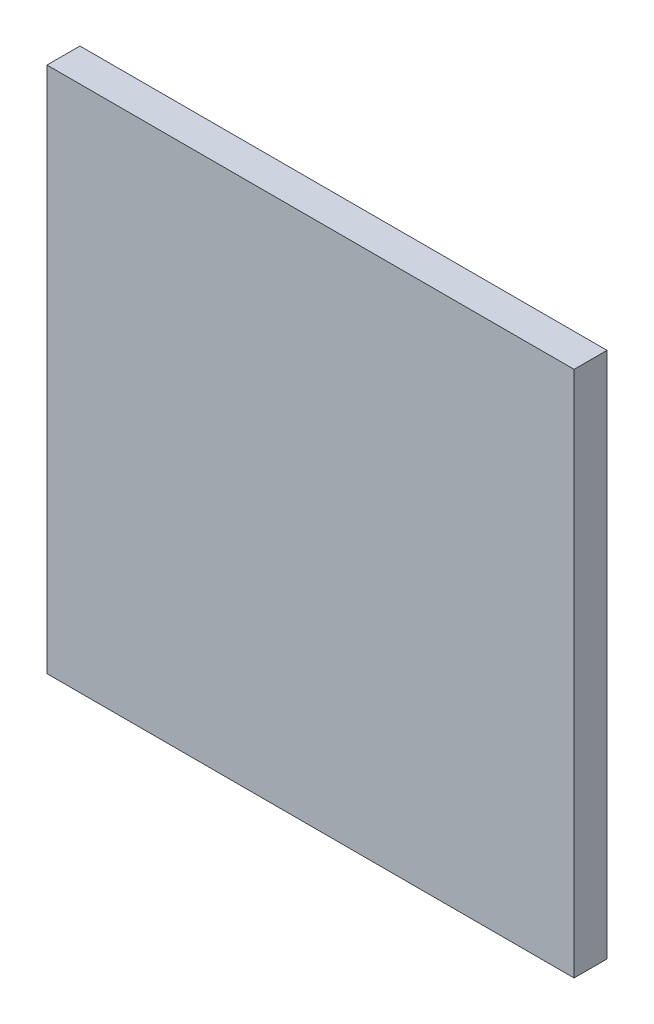
ISO-10303-21;
HEADER;
FILE_DESCRIPTION(('STEP AP214'),'2;1');
FILE_NAME('part.step','',(''),(''),'','','');
FILE_SCHEMA(('AUTOMOTIVE_DESIGN { 1 0 10303 214 1 1 1 1 }'));
ENDSEC;
DATA;
#1=APPLICATION_CONTEXT('core data for automotive mechanical design processes');
#2=APPLICATION_PROTOCOL_DEFINITION('international standard','automotive_design',2000,#1);
#3=PRODUCT_CONTEXT('',#1,'mechanical');
#4=PRODUCT('Part','Part','',(#3));
#5=PRODUCT_RELATED_PRODUCT_CATEGORY('part','',(#4));
#6=PRODUCT_DEFINITION_FORMATION('','',#4);
#7=PRODUCT_DEFINITION_CONTEXT('part definition',#1,'design');
#8=PRODUCT_DEFINITION('design','',#6,#7);
#9=PRODUCT_DEFINITION_SHAPE('','',#8);
#10=(LENGTH_UNIT() NAMED_UNIT(*) SI_UNIT(.MILLI.,.METRE.));
#11=(NAMED_UNIT(*) PLANE_ANGLE_UNIT() SI_UNIT($,.RADIAN.));
#12=(NAMED_UNIT(*) SI_UNIT($,.STERADIAN.) SOLID_ANGLE_UNIT());
#13=UNCERTAINTY_MEASURE_WITH_UNIT(LENGTH_MEASURE(1.E-05),#10,'distance_accuracy_value','');
#14=(GEOMETRIC_REPRESENTATION_CONTEXT(3) GLOBAL_UNCERTAINTY_ASSIGNED_CONTEXT((#13)) GLOBAL_UNIT_ASSIGNED_CONTEXT((#10,
#11,#12)) REPRESENTATION_CONTEXT('',''));
#15=CARTESIAN_POINT('',(0.,0.,0.));
#16=DIRECTION('',(0.,0.,1.));
#17=DIRECTION('',(1.,0.,0.));
#18=AXIS2_PLACEMENT_3D('',#15,#16,#17);
#19=CARTESIAN_POINT('',(0.,0.,2.5));
#20=DIRECTION('',(1.,0.,0.));
#21=DIRECTION('',(0.,1.,0.));
#22=AXIS2_PLACEMENT_3D('',#19,#20,#21);
#23=PLANE('',#22);
#24=DIRECTION('',(0.,-1.,0.));
#25=VECTOR('',#24,1.);
#26=CARTESIAN_POINT('',(0.,0.,0.));
#27=LINE('',#26,#25);
#28=CARTESIAN_POINT('',(0.,40.,0.));
#29=VERTEX_POINT('',#28);
#30=CARTESIAN_POINT('',(0.,0.,0.));
#31=VERTEX_POINT('',#30);
#32=EDGE_CURVE('E96',#29,#31,#27,.T.);
#33=ORIENTED_EDGE('',*,*,#32,.T.);
#34=DIRECTION('',(0.,0.,-1.));
#35=VECTOR('',#34,1.);
#36=CARTESIAN_POINT('',(0.,0.,2.5));
#37=LINE('',#36,#35);
#38=CARTESIAN_POINT('',(0.,0.,2.5));
#39=VERTEX_POINT('',#38);
#40=EDGE_CURVE('E11',#39,#31,#37,.T.);
#41=ORIENTED_EDGE('',*,*,#40,.F.);
#42=DIRECTION('',(0.,-1.,0.));
#43=VECTOR('',#42,1.);
#44=CARTESIAN_POINT('',(0.,0.,2.5));
#45=LINE('',#44,#43);
#46=CARTESIAN_POINT('',(0.,40.,2.5));
#47=VERTEX_POINT('',#46);
#48=EDGE_CURVE('E84',#47,#39,#45,.T.);
#49=ORIENTED_EDGE('',*,*,#48,.F.);
#50=DIRECTION('',(0.,0.,-1.));
#51=VECTOR('',#50,1.);
#52=CARTESIAN_POINT('',(0.,40.,2.5));
#53=LINE('',#52,#51);
#54=EDGE_CURVE('E92',#47,#29,#53,.T.);
#55=ORIENTED_EDGE('',*,*,#54,.T.);
#56=EDGE_LOOP('',(#33,#41,#49,#55));
#57=FACE_BOUND('',#56,.T.);
#58=ADVANCED_FACE('F33',(#57),#23,.F.);
#59=CARTESIAN_POINT('',(0.,0.,2.5));
#60=DIRECTION('',(0.,1.,0.));
#61=DIRECTION('',(0.,0.,1.));
#62=AXIS2_PLACEMENT_3D('',#59,#60,#61);
#63=PLANE('',#62);
#64=DIRECTION('',(1.,0.,0.));
#65=VECTOR('',#64,1.);
#66=CARTESIAN_POINT('',(0.,0.,0.));
#67=LINE('',#66,#65);
#68=CARTESIAN_POINT('',(40.,0.,0.));
#69=VERTEX_POINT('',#68);
#70=EDGE_CURVE('E88',#31,#69,#67,.T.);
#71=ORIENTED_EDGE('',*,*,#70,.T.);
#72=DIRECTION('',(0.,0.,-1.));
#73=VECTOR('',#72,1.);
#74=CARTESIAN_POINT('',(40.,0.,2.5));
#75=LINE('',#74,#73);
#76=CARTESIAN_POINT('',(40.,0.,2.5));
#77=VERTEX_POINT('',#76);
#78=EDGE_CURVE('E41',#77,#69,#75,.T.);
#79=ORIENTED_EDGE('',*,*,#78,.F.);
#80=DIRECTION('',(1.,0.,0.));
#81=VECTOR('',#80,1.);
#82=CARTESIAN_POINT('',(0.,0.,2.5));
#83=LINE('',#82,#81);
#84=EDGE_CURVE('E79',#39,#77,#83,.T.);
#85=ORIENTED_EDGE('',*,*,#84,.F.);
#86=ORIENTED_EDGE('',*,*,#40,.T.);
#87=EDGE_LOOP('',(#71,#79,#85,#86));
#88=FACE_BOUND('',#87,.T.);
#89=ADVANCED_FACE('F87',(#88),#63,.F.);
#90=CARTESIAN_POINT('',(40.,0.,2.5));
#91=DIRECTION('',(-1.,0.,0.));
#92=DIRECTION('',(0.,-1.,0.));
#93=AXIS2_PLACEMENT_3D('',#90,#91,#92);
#94=PLANE('',#93);
#95=DIRECTION('',(0.,1.,0.));
#96=VECTOR('',#95,1.);
#97=CARTESIAN_POINT('',(40.,0.,0.));
#98=LINE('',#97,#96);
#99=CARTESIAN_POINT('',(40.,40.,0.));
#100=VERTEX_POINT('',#99);
#101=EDGE_CURVE('E66',#69,#100,#98,.T.);
#102=ORIENTED_EDGE('',*,*,#101,.T.);
#103=DIRECTION('',(0.,0.,-1.));
#104=VECTOR('',#103,1.);
#105=CARTESIAN_POINT('',(40.,40.,2.5));
#106=LINE('',#105,#104);
#107=CARTESIAN_POINT('',(40.,40.,2.5));
#108=VERTEX_POINT('',#107);
#109=EDGE_CURVE('E89',#108,#100,#106,.T.);
#110=ORIENTED_EDGE('',*,*,#109,.F.);
#111=DIRECTION('',(0.,1.,0.));
#112=VECTOR('',#111,1.);
#113=CARTESIAN_POINT('',(40.,0.,2.5));
#114=LINE('',#113,#112);
#115=EDGE_CURVE('E82',#77,#108,#114,.T.);
#116=ORIENTED_EDGE('',*,*,#115,.F.);
#117=ORIENTED_EDGE('',*,*,#78,.T.);
#118=EDGE_LOOP('',(#102,#110,#116,#117));
#119=FACE_BOUND('',#118,.T.);
#120=ADVANCED_FACE('F90',(#119),#94,.F.);
#121=CARTESIAN_POINT('',(0.,40.,2.5));
#122=DIRECTION('',(0.,-1.,0.));
#123=DIRECTION('',(0.,0.,-1.));
#124=AXIS2_PLACEMENT_3D('',#121,#122,#123);
#125=PLANE('',#124);
#126=DIRECTION('',(-1.,0.,0.));
#127=VECTOR('',#126,1.);
#128=CARTESIAN_POINT('',(0.,40.,0.));
#129=LINE('',#128,#127);
#130=EDGE_CURVE('E72',#100,#29,#129,.T.);
#131=ORIENTED_EDGE('',*,*,#130,.T.);
#132=ORIENTED_EDGE('',*,*,#54,.F.);
#133=DIRECTION('',(-1.,0.,0.));
#134=VECTOR('',#133,1.);
#135=CARTESIAN_POINT('',(0.,40.,2.5));
#136=LINE('',#135,#134);
#137=EDGE_CURVE('E49',#108,#47,#136,.T.);
#138=ORIENTED_EDGE('',*,*,#137,.F.);
#139=ORIENTED_EDGE('',*,*,#109,.T.);
#140=EDGE_LOOP('',(#131,#132,#138,#139));
#141=FACE_BOUND('',#140,.T.);
#142=ADVANCED_FACE('F103',(#141),#125,.F.);
#143=CARTESIAN_POINT('',(0.,0.,2.5));
#144=DIRECTION('',(0.,0.,-1.));
#145=DIRECTION('',(-1.,0.,0.));
#146=AXIS2_PLACEMENT_3D('',#143,#144,#145);
#147=PLANE('',#146);
#148=ORIENTED_EDGE('',*,*,#48,.T.);
#149=ORIENTED_EDGE('',*,*,#84,.T.);
#150=ORIENTED_EDGE('',*,*,#115,.T.);
#151=ORIENTED_EDGE('',*,*,#137,.T.);
#152=EDGE_LOOP('',(#148,#149,#150,#151));
#153=FACE_BOUND('',#152,.T.);
#154=ADVANCED_FACE('F80',(#153),#147,.F.);
#155=CARTESIAN_POINT('',(0.,0.,0.));
#156=DIRECTION('',(0.,0.,-1.));
#157=DIRECTION('',(-1.,0.,0.));
#158=AXIS2_PLACEMENT_3D('',#155,#156,#157);
#159=PLANE('',#158);
#160=ORIENTED_EDGE('',*,*,#32,.F.);
#161=ORIENTED_EDGE('',*,*,#130,.F.);
#162=ORIENTED_EDGE('',*,*,#101,.F.);
#163=ORIENTED_EDGE('',*,*,#70,.F.);
#164=EDGE_LOOP('',(#160,#161,#162,#163));
#165=FACE_BOUND('',#164,.T.);
#166=ADVANCED_FACE('F106',(#165),#159,.T.);
#167=CLOSED_SHELL('',(#58,#89,#120,#142,#154,#166));
#168=MANIFOLD_SOLID_BREP('B2',#167);
#169=ADVANCED_BREP_SHAPE_REPRESENTATION('',(#18,#168),#14);
#170=SHAPE_DEFINITION_REPRESENTATION(#9,#169);
ENDSEC;
END-ISO-10303-21;
